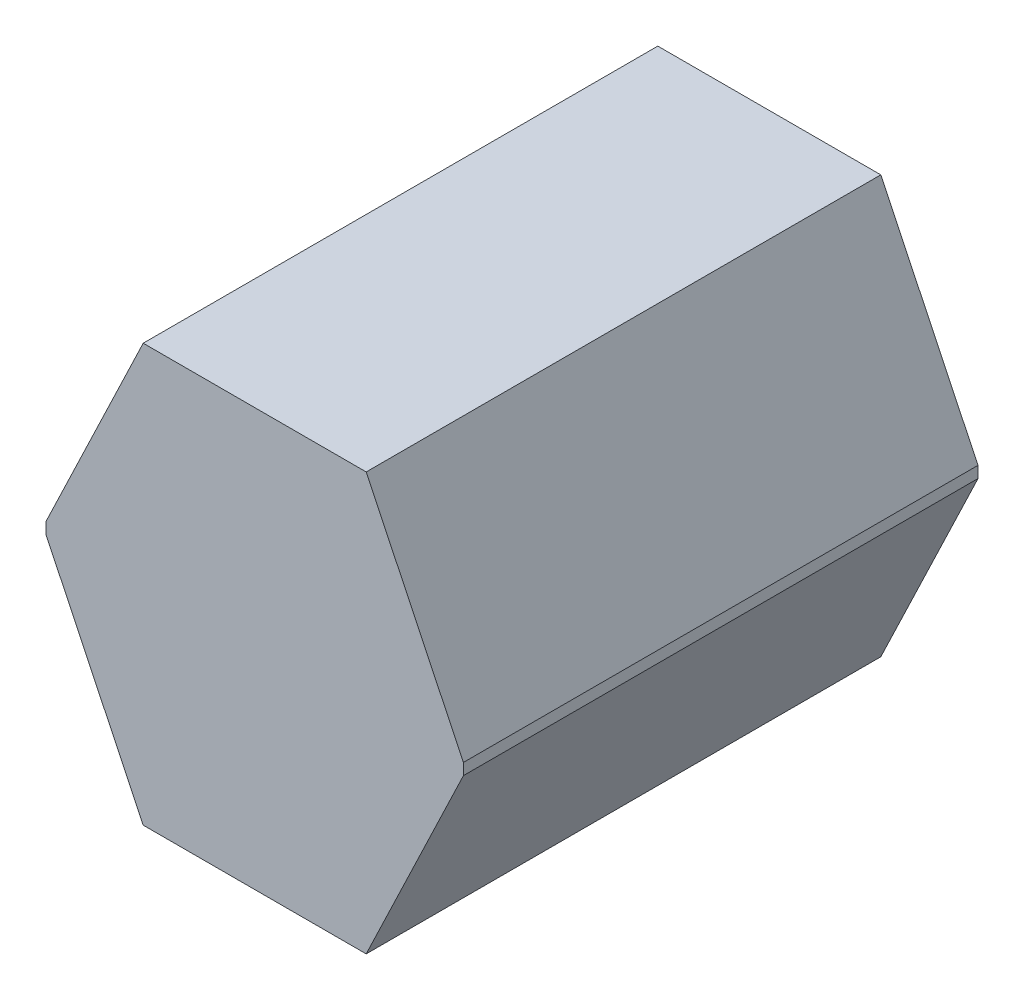
ISO-10303-21;
HEADER;
FILE_DESCRIPTION(('STEP AP214'),'2;1');
FILE_NAME('part.step','',(''),(''),'','','');
FILE_SCHEMA(('AUTOMOTIVE_DESIGN { 1 0 10303 214 1 1 1 1 }'));
ENDSEC;
DATA;
#1=APPLICATION_CONTEXT('core data for automotive mechanical design processes');
#2=APPLICATION_PROTOCOL_DEFINITION('international standard','automotive_design',2000,#1);
#3=PRODUCT_CONTEXT('',#1,'mechanical');
#4=PRODUCT('Part','Part','',(#3));
#5=PRODUCT_RELATED_PRODUCT_CATEGORY('part','',(#4));
#6=PRODUCT_DEFINITION_FORMATION('','',#4);
#7=PRODUCT_DEFINITION_CONTEXT('part definition',#1,'design');
#8=PRODUCT_DEFINITION('design','',#6,#7);
#9=PRODUCT_DEFINITION_SHAPE('','',#8);
#10=(LENGTH_UNIT() NAMED_UNIT(*) SI_UNIT(.MILLI.,.METRE.));
#11=(NAMED_UNIT(*) PLANE_ANGLE_UNIT() SI_UNIT($,.RADIAN.));
#12=(NAMED_UNIT(*) SI_UNIT($,.STERADIAN.) SOLID_ANGLE_UNIT());
#13=UNCERTAINTY_MEASURE_WITH_UNIT(LENGTH_MEASURE(1.E-05),#10,'distance_accuracy_value','');
#14=(GEOMETRIC_REPRESENTATION_CONTEXT(3) GLOBAL_UNCERTAINTY_ASSIGNED_CONTEXT((#13)) GLOBAL_UNIT_ASSIGNED_CONTEXT((#10,
#11,#12)) REPRESENTATION_CONTEXT('',''));
#15=CARTESIAN_POINT('',(0.,0.,0.));
#16=DIRECTION('',(0.,0.,1.));
#17=DIRECTION('',(1.,0.,0.));
#18=AXIS2_PLACEMENT_3D('',#15,#16,#17);
#19=CARTESIAN_POINT('',(97.5,-182.5,450.));
#20=DIRECTION('',(0.,1.,0.));
#21=DIRECTION('',(0.,0.,1.));
#22=AXIS2_PLACEMENT_3D('',#19,#20,#21);
#23=PLANE('',#22);
#24=DIRECTION('',(1.,0.,0.));
#25=VECTOR('',#24,1.);
#26=CARTESIAN_POINT('',(97.5,-182.5,0.));
#27=LINE('',#26,#25);
#28=CARTESIAN_POINT('',(-97.5,-182.5,0.));
#29=VERTEX_POINT('',#28);
#30=CARTESIAN_POINT('',(97.5,-182.5,0.));
#31=VERTEX_POINT('',#30);
#32=EDGE_CURVE('E130',#29,#31,#27,.T.);
#33=ORIENTED_EDGE('',*,*,#32,.T.);
#34=DIRECTION('',(0.,0.,-1.));
#35=VECTOR('',#34,1.);
#36=CARTESIAN_POINT('',(97.5,-182.5,450.));
#37=LINE('',#36,#35);
#38=CARTESIAN_POINT('',(97.5,-182.5,450.));
#39=VERTEX_POINT('',#38);
#40=EDGE_CURVE('E11',#39,#31,#37,.T.);
#41=ORIENTED_EDGE('',*,*,#40,.F.);
#42=DIRECTION('',(1.,0.,0.));
#43=VECTOR('',#42,1.);
#44=CARTESIAN_POINT('',(97.5,-182.5,450.));
#45=LINE('',#44,#43);
#46=CARTESIAN_POINT('',(-97.5,-182.5,450.));
#47=VERTEX_POINT('',#46);
#48=EDGE_CURVE('E144',#47,#39,#45,.T.);
#49=ORIENTED_EDGE('',*,*,#48,.F.);
#50=DIRECTION('',(0.,0.,-1.));
#51=VECTOR('',#50,1.);
#52=CARTESIAN_POINT('',(-97.5,-182.5,450.));
#53=LINE('',#52,#51);
#54=EDGE_CURVE('E126',#47,#29,#53,.T.);
#55=ORIENTED_EDGE('',*,*,#54,.T.);
#56=EDGE_LOOP('',(#33,#41,#49,#55));
#57=FACE_BOUND('',#56,.T.);
#58=ADVANCED_FACE('F34',(#57),#23,.F.);
#59=CARTESIAN_POINT('',(97.5,-182.5,450.));
#60=DIRECTION('',(-0.901919134345837,0.431904937574063,0.));
#61=DIRECTION('',(-0.431904937574063,-0.901919134345837,0.));
#62=AXIS2_PLACEMENT_3D('',#59,#60,#61);
#63=PLANE('',#62);
#64=DIRECTION('',(0.431904937574063,0.901919134345837,0.));
#65=VECTOR('',#64,1.);
#66=CARTESIAN_POINT('',(97.5,-182.5,0.));
#67=LINE('',#66,#65);
#68=CARTESIAN_POINT('',(182.5,-4.99999999999998,0.));
#69=VERTEX_POINT('',#68);
#70=EDGE_CURVE('E133',#31,#69,#67,.T.);
#71=ORIENTED_EDGE('',*,*,#70,.T.);
#72=DIRECTION('',(0.,0.,-1.));
#73=VECTOR('',#72,1.);
#74=CARTESIAN_POINT('',(182.5,-4.99999999999998,450.));
#75=LINE('',#74,#73);
#76=CARTESIAN_POINT('',(182.5,-4.99999999999998,450.));
#77=VERTEX_POINT('',#76);
#78=EDGE_CURVE('E42',#77,#69,#75,.T.);
#79=ORIENTED_EDGE('',*,*,#78,.F.);
#80=DIRECTION('',(0.431904937574063,0.901919134345837,0.));
#81=VECTOR('',#80,1.);
#82=CARTESIAN_POINT('',(97.5,-182.5,450.));
#83=LINE('',#82,#81);
#84=EDGE_CURVE('E93',#39,#77,#83,.T.);
#85=ORIENTED_EDGE('',*,*,#84,.F.);
#86=ORIENTED_EDGE('',*,*,#40,.T.);
#87=EDGE_LOOP('',(#71,#79,#85,#86));
#88=FACE_BOUND('',#87,.T.);
#89=ADVANCED_FACE('F179',(#88),#63,.F.);
#90=CARTESIAN_POINT('',(182.5,5.00000000000002,450.));
#91=DIRECTION('',(-1.,0.,0.));
#92=DIRECTION('',(0.,0.,1.));
#93=AXIS2_PLACEMENT_3D('',#90,#91,#92);
#94=PLANE('',#93);
#95=DIRECTION('',(0.,1.,0.));
#96=VECTOR('',#95,1.);
#97=CARTESIAN_POINT('',(182.5,5.00000000000002,0.));
#98=LINE('',#97,#96);
#99=CARTESIAN_POINT('',(182.5,5.00000000000002,0.));
#100=VERTEX_POINT('',#99);
#101=EDGE_CURVE('E135',#69,#100,#98,.T.);
#102=ORIENTED_EDGE('',*,*,#101,.T.);
#103=DIRECTION('',(0.,0.,-1.));
#104=VECTOR('',#103,1.);
#105=CARTESIAN_POINT('',(182.5,5.00000000000002,450.));
#106=LINE('',#105,#104);
#107=CARTESIAN_POINT('',(182.5,5.00000000000002,450.));
#108=VERTEX_POINT('',#107);
#109=EDGE_CURVE('E151',#108,#100,#106,.T.);
#110=ORIENTED_EDGE('',*,*,#109,.F.);
#111=DIRECTION('',(0.,1.,0.));
#112=VECTOR('',#111,1.);
#113=CARTESIAN_POINT('',(182.5,5.00000000000002,450.));
#114=LINE('',#113,#112);
#115=EDGE_CURVE('E159',#77,#108,#114,.T.);
#116=ORIENTED_EDGE('',*,*,#115,.F.);
#117=ORIENTED_EDGE('',*,*,#78,.T.);
#118=EDGE_LOOP('',(#102,#110,#116,#117));
#119=FACE_BOUND('',#118,.T.);
#120=ADVANCED_FACE('F157',(#119),#94,.F.);
#121=CARTESIAN_POINT('',(97.5,182.5,450.));
#122=DIRECTION('',(-0.901919134345837,-0.431904937574063,0.));
#123=DIRECTION('',(0.431904937574063,-0.901919134345837,0.));
#124=AXIS2_PLACEMENT_3D('',#121,#122,#123);
#125=PLANE('',#124);
#126=DIRECTION('',(-0.431904937574063,0.901919134345837,0.));
#127=VECTOR('',#126,1.);
#128=CARTESIAN_POINT('',(97.5,182.5,0.));
#129=LINE('',#128,#127);
#130=CARTESIAN_POINT('',(97.5,182.5,0.));
#131=VERTEX_POINT('',#130);
#132=EDGE_CURVE('E137',#100,#131,#129,.T.);
#133=ORIENTED_EDGE('',*,*,#132,.T.);
#134=DIRECTION('',(0.,0.,-1.));
#135=VECTOR('',#134,1.);
#136=CARTESIAN_POINT('',(97.5,182.5,450.));
#137=LINE('',#136,#135);
#138=CARTESIAN_POINT('',(97.5,182.5,450.));
#139=VERTEX_POINT('',#138);
#140=EDGE_CURVE('E148',#139,#131,#137,.T.);
#141=ORIENTED_EDGE('',*,*,#140,.F.);
#142=DIRECTION('',(-0.431904937574063,0.901919134345837,0.));
#143=VECTOR('',#142,1.);
#144=CARTESIAN_POINT('',(97.5,182.5,450.));
#145=LINE('',#144,#143);
#146=EDGE_CURVE('E171',#108,#139,#145,.T.);
#147=ORIENTED_EDGE('',*,*,#146,.F.);
#148=ORIENTED_EDGE('',*,*,#109,.T.);
#149=EDGE_LOOP('',(#133,#141,#147,#148));
#150=FACE_BOUND('',#149,.T.);
#151=ADVANCED_FACE('F167',(#150),#125,.F.);
#152=CARTESIAN_POINT('',(97.5,182.5,450.));
#153=DIRECTION('',(0.,-1.,0.));
#154=DIRECTION('',(0.,0.,-1.));
#155=AXIS2_PLACEMENT_3D('',#152,#153,#154);
#156=PLANE('',#155);
#157=DIRECTION('',(-1.,0.,0.));
#158=VECTOR('',#157,1.);
#159=CARTESIAN_POINT('',(97.5,182.5,0.));
#160=LINE('',#159,#158);
#161=CARTESIAN_POINT('',(-97.5,182.5,0.));
#162=VERTEX_POINT('',#161);
#163=EDGE_CURVE('E139',#131,#162,#160,.T.);
#164=ORIENTED_EDGE('',*,*,#163,.T.);
#165=DIRECTION('',(0.,0.,-1.));
#166=VECTOR('',#165,1.);
#167=CARTESIAN_POINT('',(-97.5,182.5,450.));
#168=LINE('',#167,#166);
#169=CARTESIAN_POINT('',(-97.5,182.5,450.));
#170=VERTEX_POINT('',#169);
#171=EDGE_CURVE('E121',#170,#162,#168,.T.);
#172=ORIENTED_EDGE('',*,*,#171,.F.);
#173=DIRECTION('',(-1.,0.,0.));
#174=VECTOR('',#173,1.);
#175=CARTESIAN_POINT('',(97.5,182.5,450.));
#176=LINE('',#175,#174);
#177=EDGE_CURVE('E112',#139,#170,#176,.T.);
#178=ORIENTED_EDGE('',*,*,#177,.F.);
#179=ORIENTED_EDGE('',*,*,#140,.T.);
#180=EDGE_LOOP('',(#164,#172,#178,#179));
#181=FACE_BOUND('',#180,.T.);
#182=ADVANCED_FACE('F170',(#181),#156,.F.);
#183=CARTESIAN_POINT('',(-97.5,182.5,450.));
#184=DIRECTION('',(0.901919134345837,-0.431904937574063,0.));
#185=DIRECTION('',(0.431904937574063,0.901919134345837,0.));
#186=AXIS2_PLACEMENT_3D('',#183,#184,#185);
#187=PLANE('',#186);
#188=DIRECTION('',(-0.431904937574063,-0.901919134345837,0.));
#189=VECTOR('',#188,1.);
#190=CARTESIAN_POINT('',(-97.5,182.5,0.));
#191=LINE('',#190,#189);
#192=CARTESIAN_POINT('',(-182.5,4.99999999999998,0.));
#193=VERTEX_POINT('',#192);
#194=EDGE_CURVE('E120',#162,#193,#191,.T.);
#195=ORIENTED_EDGE('',*,*,#194,.T.);
#196=DIRECTION('',(0.,0.,-1.));
#197=VECTOR('',#196,1.);
#198=CARTESIAN_POINT('',(-182.5,4.99999999999998,450.));
#199=LINE('',#198,#197);
#200=CARTESIAN_POINT('',(-182.5,4.99999999999998,450.));
#201=VERTEX_POINT('',#200);
#202=EDGE_CURVE('E117',#201,#193,#199,.T.);
#203=ORIENTED_EDGE('',*,*,#202,.F.);
#204=DIRECTION('',(-0.431904937574063,-0.901919134345837,0.));
#205=VECTOR('',#204,1.);
#206=CARTESIAN_POINT('',(-97.5,182.5,450.));
#207=LINE('',#206,#205);
#208=EDGE_CURVE('E106',#170,#201,#207,.T.);
#209=ORIENTED_EDGE('',*,*,#208,.F.);
#210=ORIENTED_EDGE('',*,*,#171,.T.);
#211=EDGE_LOOP('',(#195,#203,#209,#210));
#212=FACE_BOUND('',#211,.T.);
#213=ADVANCED_FACE('F118',(#212),#187,.F.);
#214=CARTESIAN_POINT('',(-182.5,4.99999999999998,450.));
#215=DIRECTION('',(1.,0.,0.));
#216=DIRECTION('',(0.,0.,-1.));
#217=AXIS2_PLACEMENT_3D('',#214,#215,#216);
#218=PLANE('',#217);
#219=DIRECTION('',(0.,-1.,0.));
#220=VECTOR('',#219,1.);
#221=CARTESIAN_POINT('',(-182.5,4.99999999999998,0.));
#222=LINE('',#221,#220);
#223=CARTESIAN_POINT('',(-182.5,-5.00000000000002,0.));
#224=VERTEX_POINT('',#223);
#225=EDGE_CURVE('E79',#193,#224,#222,.T.);
#226=ORIENTED_EDGE('',*,*,#225,.T.);
#227=DIRECTION('',(0.,0.,-1.));
#228=VECTOR('',#227,1.);
#229=CARTESIAN_POINT('',(-182.5,-5.00000000000002,450.));
#230=LINE('',#229,#228);
#231=CARTESIAN_POINT('',(-182.5,-5.00000000000002,450.));
#232=VERTEX_POINT('',#231);
#233=EDGE_CURVE('E122',#232,#224,#230,.T.);
#234=ORIENTED_EDGE('',*,*,#233,.F.);
#235=DIRECTION('',(0.,-1.,0.));
#236=VECTOR('',#235,1.);
#237=CARTESIAN_POINT('',(-182.5,4.99999999999998,450.));
#238=LINE('',#237,#236);
#239=EDGE_CURVE('E110',#201,#232,#238,.T.);
#240=ORIENTED_EDGE('',*,*,#239,.F.);
#241=ORIENTED_EDGE('',*,*,#202,.T.);
#242=EDGE_LOOP('',(#226,#234,#240,#241));
#243=FACE_BOUND('',#242,.T.);
#244=ADVANCED_FACE('F124',(#243),#218,.F.);
#245=CARTESIAN_POINT('',(-97.5,-182.5,450.));
#246=DIRECTION('',(0.901919134345837,0.431904937574063,0.));
#247=DIRECTION('',(-0.431904937574063,0.901919134345838,0.));
#248=AXIS2_PLACEMENT_3D('',#245,#246,#247);
#249=PLANE('',#248);
#250=DIRECTION('',(0.431904937574063,-0.901919134345837,0.));
#251=VECTOR('',#250,1.);
#252=CARTESIAN_POINT('',(-97.5,-182.5,0.));
#253=LINE('',#252,#251);
#254=EDGE_CURVE('E85',#224,#29,#253,.T.);
#255=ORIENTED_EDGE('',*,*,#254,.T.);
#256=ORIENTED_EDGE('',*,*,#54,.F.);
#257=DIRECTION('',(0.431904937574063,-0.901919134345837,0.));
#258=VECTOR('',#257,1.);
#259=CARTESIAN_POINT('',(-97.5,-182.5,450.));
#260=LINE('',#259,#258);
#261=EDGE_CURVE('E50',#232,#47,#260,.T.);
#262=ORIENTED_EDGE('',*,*,#261,.F.);
#263=ORIENTED_EDGE('',*,*,#233,.T.);
#264=EDGE_LOOP('',(#255,#256,#262,#263));
#265=FACE_BOUND('',#264,.T.);
#266=ADVANCED_FACE('F195',(#265),#249,.F.);
#267=CARTESIAN_POINT('',(0.,0.,450.));
#268=DIRECTION('',(0.,0.,1.));
#269=DIRECTION('',(1.,0.,0.));
#270=AXIS2_PLACEMENT_3D('',#267,#268,#269);
#271=PLANE('',#270);
#272=ORIENTED_EDGE('',*,*,#48,.T.);
#273=ORIENTED_EDGE('',*,*,#84,.T.);
#274=ORIENTED_EDGE('',*,*,#115,.T.);
#275=ORIENTED_EDGE('',*,*,#146,.T.);
#276=ORIENTED_EDGE('',*,*,#177,.T.);
#277=ORIENTED_EDGE('',*,*,#208,.T.);
#278=ORIENTED_EDGE('',*,*,#239,.T.);
#279=ORIENTED_EDGE('',*,*,#261,.T.);
#280=EDGE_LOOP('',(#272,#273,#274,#275,#276,#277,#278,#279));
#281=FACE_BOUND('',#280,.T.);
#282=ADVANCED_FACE('F108',(#281),#271,.T.);
#283=CARTESIAN_POINT('',(0.,0.,0.));
#284=DIRECTION('',(0.,0.,1.));
#285=DIRECTION('',(1.,0.,0.));
#286=AXIS2_PLACEMENT_3D('',#283,#284,#285);
#287=PLANE('',#286);
#288=ORIENTED_EDGE('',*,*,#32,.F.);
#289=ORIENTED_EDGE('',*,*,#254,.F.);
#290=ORIENTED_EDGE('',*,*,#225,.F.);
#291=ORIENTED_EDGE('',*,*,#194,.F.);
#292=ORIENTED_EDGE('',*,*,#163,.F.);
#293=ORIENTED_EDGE('',*,*,#132,.F.);
#294=ORIENTED_EDGE('',*,*,#101,.F.);
#295=ORIENTED_EDGE('',*,*,#70,.F.);
#296=EDGE_LOOP('',(#288,#289,#290,#291,#292,#293,#294,#295));
#297=FACE_BOUND('',#296,.T.);
#298=ADVANCED_FACE('F163',(#297),#287,.F.);
#299=CLOSED_SHELL('',(#58,#89,#120,#151,#182,#213,#244,#266,#282,#298));
#300=MANIFOLD_SOLID_BREP('B2',#299);
#301=ADVANCED_BREP_SHAPE_REPRESENTATION('',(#18,#300),#14);
#302=SHAPE_DEFINITION_REPRESENTATION(#9,#301);
ENDSEC;
END-ISO-10303-21;
